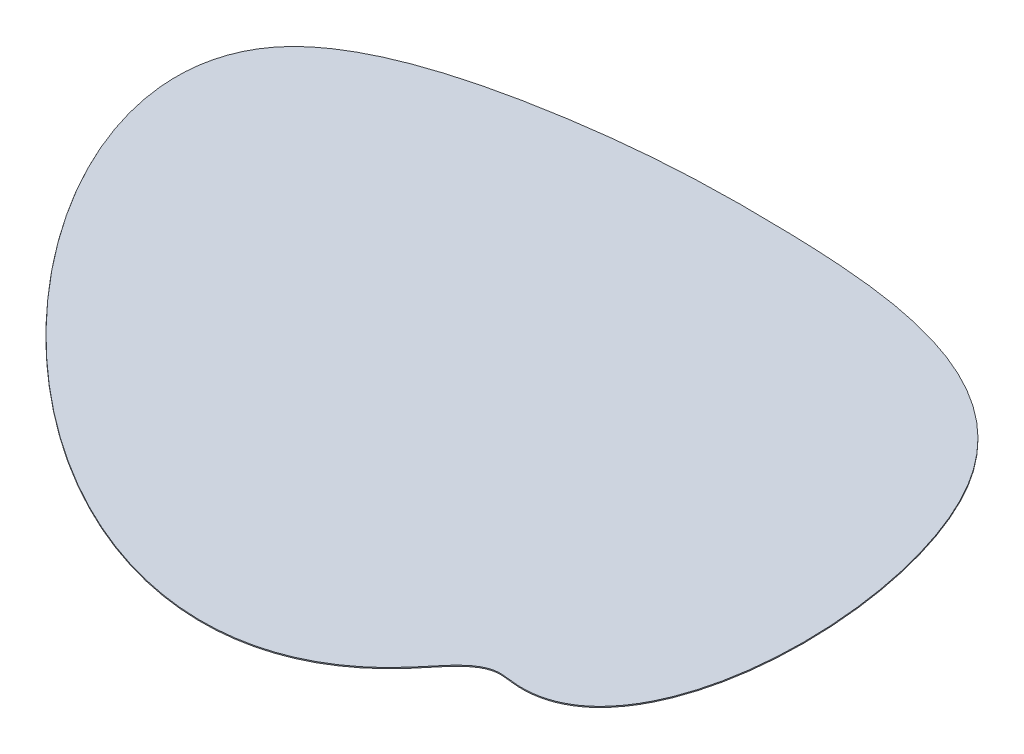
ISO-10303-21;
HEADER;
FILE_DESCRIPTION(('STEP AP214'),'2;1');
FILE_NAME('part.step','',(''),(''),'','','');
FILE_SCHEMA(('AUTOMOTIVE_DESIGN { 1 0 10303 214 1 1 1 1 }'));
ENDSEC;
DATA;
#1=APPLICATION_CONTEXT('core data for automotive mechanical design processes');
#2=APPLICATION_PROTOCOL_DEFINITION('international standard','automotive_design',2000,#1);
#3=PRODUCT_CONTEXT('',#1,'mechanical');
#4=PRODUCT('Part','Part','',(#3));
#5=PRODUCT_RELATED_PRODUCT_CATEGORY('part','',(#4));
#6=PRODUCT_DEFINITION_FORMATION('','',#4);
#7=PRODUCT_DEFINITION_CONTEXT('part definition',#1,'design');
#8=PRODUCT_DEFINITION('design','',#6,#7);
#9=PRODUCT_DEFINITION_SHAPE('','',#8);
#10=(LENGTH_UNIT() NAMED_UNIT(*) SI_UNIT(.MILLI.,.METRE.));
#11=(NAMED_UNIT(*) PLANE_ANGLE_UNIT() SI_UNIT($,.RADIAN.));
#12=(NAMED_UNIT(*) SI_UNIT($,.STERADIAN.) SOLID_ANGLE_UNIT());
#13=UNCERTAINTY_MEASURE_WITH_UNIT(LENGTH_MEASURE(1.E-05),#10,'distance_accuracy_value','');
#14=(GEOMETRIC_REPRESENTATION_CONTEXT(3) GLOBAL_UNCERTAINTY_ASSIGNED_CONTEXT((#13)) GLOBAL_UNIT_ASSIGNED_CONTEXT((#10,
#11,#12)) REPRESENTATION_CONTEXT('',''));
#15=CARTESIAN_POINT('',(0.,0.,0.));
#16=DIRECTION('',(0.,0.,1.));
#17=DIRECTION('',(1.,0.,0.));
#18=AXIS2_PLACEMENT_3D('',#15,#16,#17);
#19=CARTESIAN_POINT('',(-3.33066907387547E-13,10.,-2754.01202964398));
#20=CARTESIAN_POINT('',(-742.852763110572,10.,-2774.66144681233));
#21=CARTESIAN_POINT('',(-2053.01719588434,10.,-2727.09155333088));
#22=CARTESIAN_POINT('',(-5353.88408677602,10.,-1853.36357864542));
#23=CARTESIAN_POINT('',(-2858.20678051887,10.,2681.26250962825));
#24=CARTESIAN_POINT('',(1017.3505562374,10.,4130.0416785395));
#25=CARTESIAN_POINT('',(2134.2060277855,10.,2380.45221367267));
#26=CARTESIAN_POINT('',(3779.99386430483,10.,2678.69972251074));
#27=CARTESIAN_POINT('',(3840.80106566617,10.,-2436.69820204876));
#28=CARTESIAN_POINT('',(1092.78384173463,10.,-2723.63541863383));
#29=CARTESIAN_POINT('',(-3.33066907387547E-13,10.,-2754.01202964398));
#30=B_SPLINE_CURVE_WITH_KNOTS('',3,(#19,#20,#21,#22,#23,#24,#25,#26,#27,#28,#29),.UNSPECIFIED.,
.T.,.F.,(4,1,1,1,1,1,1,1,4),(0.,0.105406896183873,0.203270675180265,0.405015884805153,
0.616441117462969,0.646108874138539,0.653603117270507,0.844939726043677,1.),.UNSPECIFIED.);
#31=DIRECTION('',(0.,-1.,0.));
#32=VECTOR('',#31,1.);
#33=SURFACE_OF_LINEAR_EXTRUSION('',#30,#32);
#34=CARTESIAN_POINT('',(-3.33066907387547E-13,10.,-2754.01202964398));
#35=VERTEX_POINT('',#34);
#36=EDGE_CURVE('E10',#35,#35,#30,.T.);
#37=ORIENTED_EDGE('',*,*,#36,.F.);
#38=EDGE_LOOP('',(#37));
#39=FACE_BOUND('',#38,.T.);
#40=CARTESIAN_POINT('',(-3.33066907387547E-13,0.,-2754.01202964398));
#41=CARTESIAN_POINT('',(-742.852763110572,0.,-2774.66144681233));
#42=CARTESIAN_POINT('',(-2053.01719588434,0.,-2727.09155333088));
#43=CARTESIAN_POINT('',(-5353.88408677602,0.,-1853.36357864542));
#44=CARTESIAN_POINT('',(-2858.20678051887,0.,2681.26250962825));
#45=CARTESIAN_POINT('',(1017.3505562374,0.,4130.0416785395));
#46=CARTESIAN_POINT('',(2134.2060277855,0.,2380.45221367267));
#47=CARTESIAN_POINT('',(3779.99386430483,0.,2678.69972251074));
#48=CARTESIAN_POINT('',(3840.80106566617,0.,-2436.69820204876));
#49=CARTESIAN_POINT('',(1092.78384173463,0.,-2723.63541863383));
#50=CARTESIAN_POINT('',(-3.33066907387547E-13,0.,-2754.01202964398));
#51=B_SPLINE_CURVE_WITH_KNOTS('',3,(#40,#41,#42,#43,#44,#45,#46,#47,#48,#49,#50),.UNSPECIFIED.,
.T.,.F.,(4,1,1,1,1,1,1,1,4),(0.,0.105406896183873,0.203270675180265,0.405015884805153,
0.616441117462969,0.646108874138539,0.653603117270507,0.844939726043677,1.),.UNSPECIFIED.);
#52=CARTESIAN_POINT('',(-3.33066907387547E-13,0.,-2754.01202964398));
#53=VERTEX_POINT('',#52);
#54=EDGE_CURVE('E37',#53,#53,#51,.T.);
#55=ORIENTED_EDGE('',*,*,#54,.T.);
#56=EDGE_LOOP('',(#55));
#57=FACE_BOUND('',#56,.T.);
#58=ADVANCED_FACE('F33',(#39,#57),#33,.F.);
#59=CARTESIAN_POINT('',(-450.814756191043,10.,3307.2704397612));
#60=DIRECTION('',(0.,1.,0.));
#61=DIRECTION('',(0.,0.,1.));
#62=AXIS2_PLACEMENT_3D('',#59,#60,#61);
#63=PLANE('',#62);
#64=ORIENTED_EDGE('',*,*,#36,.T.);
#65=EDGE_LOOP('',(#64));
#66=FACE_BOUND('',#65,.T.);
#67=ADVANCED_FACE('F56',(#66),#63,.T.);
#68=CARTESIAN_POINT('',(-450.814756191043,0.,3307.2704397612));
#69=DIRECTION('',(0.,1.,0.));
#70=DIRECTION('',(0.,0.,1.));
#71=AXIS2_PLACEMENT_3D('',#68,#69,#70);
#72=PLANE('',#71);
#73=ORIENTED_EDGE('',*,*,#54,.F.);
#74=EDGE_LOOP('',(#73));
#75=FACE_BOUND('',#74,.T.);
#76=ADVANCED_FACE('F54',(#75),#72,.F.);
#77=CLOSED_SHELL('',(#58,#67,#76));
#78=MANIFOLD_SOLID_BREP('B2',#77);
#79=ADVANCED_BREP_SHAPE_REPRESENTATION('',(#18,#78),#14);
#80=SHAPE_DEFINITION_REPRESENTATION(#9,#79);
ENDSEC;
END-ISO-10303-21;
